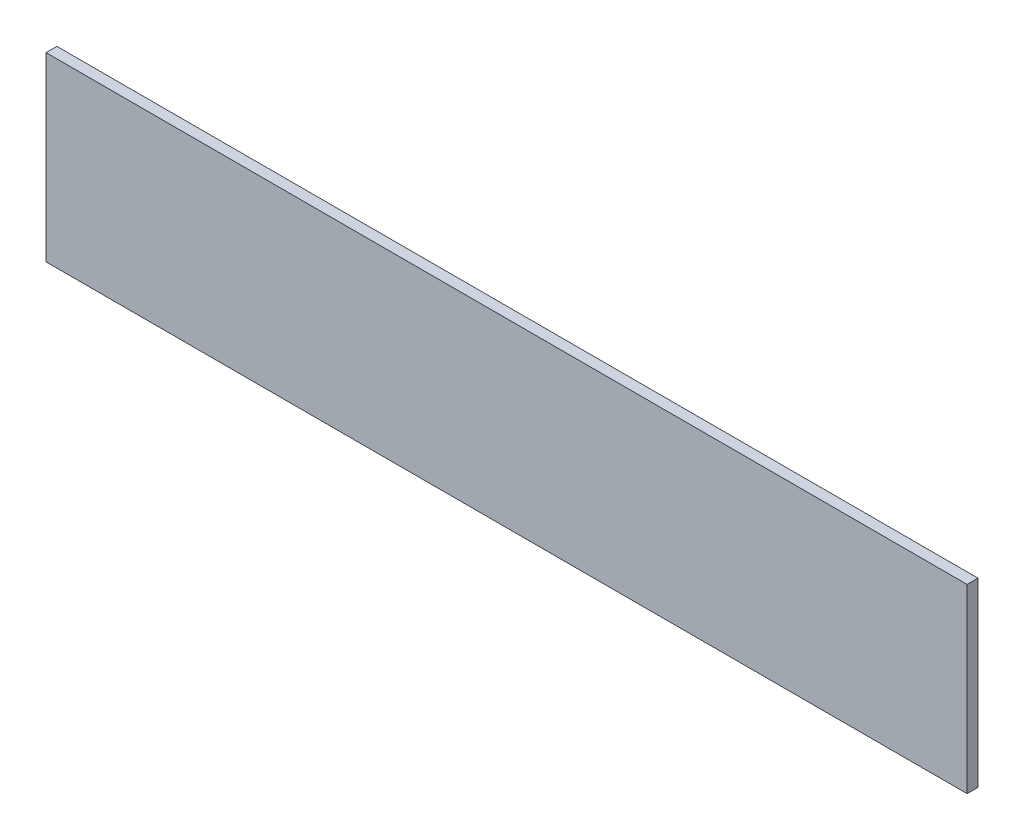
ISO-10303-21;
HEADER;
FILE_DESCRIPTION(('STEP AP214'),'2;1');
FILE_NAME('part.step','',(''),(''),'','','');
FILE_SCHEMA(('AUTOMOTIVE_DESIGN { 1 0 10303 214 1 1 1 1 }'));
ENDSEC;
DATA;
#1=APPLICATION_CONTEXT('core data for automotive mechanical design processes');
#2=APPLICATION_PROTOCOL_DEFINITION('international standard','automotive_design',2000,#1);
#3=PRODUCT_CONTEXT('',#1,'mechanical');
#4=PRODUCT('Part','Part','',(#3));
#5=PRODUCT_RELATED_PRODUCT_CATEGORY('part','',(#4));
#6=PRODUCT_DEFINITION_FORMATION('','',#4);
#7=PRODUCT_DEFINITION_CONTEXT('part definition',#1,'design');
#8=PRODUCT_DEFINITION('design','',#6,#7);
#9=PRODUCT_DEFINITION_SHAPE('','',#8);
#10=(LENGTH_UNIT() NAMED_UNIT(*) SI_UNIT(.MILLI.,.METRE.));
#11=(NAMED_UNIT(*) PLANE_ANGLE_UNIT() SI_UNIT($,.RADIAN.));
#12=(NAMED_UNIT(*) SI_UNIT($,.STERADIAN.) SOLID_ANGLE_UNIT());
#13=UNCERTAINTY_MEASURE_WITH_UNIT(LENGTH_MEASURE(1.E-05),#10,'distance_accuracy_value','');
#14=(GEOMETRIC_REPRESENTATION_CONTEXT(3) GLOBAL_UNCERTAINTY_ASSIGNED_CONTEXT((#13)) GLOBAL_UNIT_ASSIGNED_CONTEXT((#10,
#11,#12)) REPRESENTATION_CONTEXT('',''));
#15=CARTESIAN_POINT('',(0.,0.,0.));
#16=DIRECTION('',(0.,0.,1.));
#17=DIRECTION('',(1.,0.,0.));
#18=AXIS2_PLACEMENT_3D('',#15,#16,#17);
#19=CARTESIAN_POINT('',(762.5,150.,18.));
#20=DIRECTION('',(-1.,0.,0.));
#21=DIRECTION('',(0.,0.,1.));
#22=AXIS2_PLACEMENT_3D('',#19,#20,#21);
#23=PLANE('',#22);
#24=DIRECTION('',(0.,1.,0.));
#25=VECTOR('',#24,1.);
#26=CARTESIAN_POINT('',(762.5,150.,0.));
#27=LINE('',#26,#25);
#28=CARTESIAN_POINT('',(762.5,-150.,0.));
#29=VERTEX_POINT('',#28);
#30=CARTESIAN_POINT('',(762.5,150.,0.));
#31=VERTEX_POINT('',#30);
#32=EDGE_CURVE('E95',#29,#31,#27,.T.);
#33=ORIENTED_EDGE('',*,*,#32,.T.);
#34=DIRECTION('',(0.,0.,-1.));
#35=VECTOR('',#34,1.);
#36=CARTESIAN_POINT('',(762.5,150.,18.));
#37=LINE('',#36,#35);
#38=CARTESIAN_POINT('',(762.5,150.,18.));
#39=VERTEX_POINT('',#38);
#40=EDGE_CURVE('E11',#39,#31,#37,.T.);
#41=ORIENTED_EDGE('',*,*,#40,.F.);
#42=DIRECTION('',(0.,1.,0.));
#43=VECTOR('',#42,1.);
#44=CARTESIAN_POINT('',(762.5,150.,18.));
#45=LINE('',#44,#43);
#46=CARTESIAN_POINT('',(762.5,-150.,18.));
#47=VERTEX_POINT('',#46);
#48=EDGE_CURVE('E83',#47,#39,#45,.T.);
#49=ORIENTED_EDGE('',*,*,#48,.F.);
#50=DIRECTION('',(0.,0.,-1.));
#51=VECTOR('',#50,1.);
#52=CARTESIAN_POINT('',(762.5,-150.,18.));
#53=LINE('',#52,#51);
#54=EDGE_CURVE('E91',#47,#29,#53,.T.);
#55=ORIENTED_EDGE('',*,*,#54,.T.);
#56=EDGE_LOOP('',(#33,#41,#49,#55));
#57=FACE_BOUND('',#56,.T.);
#58=ADVANCED_FACE('F32',(#57),#23,.F.);
#59=CARTESIAN_POINT('',(-762.5,150.,18.));
#60=DIRECTION('',(0.,-1.,0.));
#61=DIRECTION('',(0.,0.,-1.));
#62=AXIS2_PLACEMENT_3D('',#59,#60,#61);
#63=PLANE('',#62);
#64=DIRECTION('',(-1.,0.,0.));
#65=VECTOR('',#64,1.);
#66=CARTESIAN_POINT('',(-762.5,150.,0.));
#67=LINE('',#66,#65);
#68=CARTESIAN_POINT('',(-762.5,150.,0.));
#69=VERTEX_POINT('',#68);
#70=EDGE_CURVE('E87',#31,#69,#67,.T.);
#71=ORIENTED_EDGE('',*,*,#70,.T.);
#72=DIRECTION('',(0.,0.,-1.));
#73=VECTOR('',#72,1.);
#74=CARTESIAN_POINT('',(-762.5,150.,18.));
#75=LINE('',#74,#73);
#76=CARTESIAN_POINT('',(-762.5,150.,18.));
#77=VERTEX_POINT('',#76);
#78=EDGE_CURVE('E40',#77,#69,#75,.T.);
#79=ORIENTED_EDGE('',*,*,#78,.F.);
#80=DIRECTION('',(-1.,0.,0.));
#81=VECTOR('',#80,1.);
#82=CARTESIAN_POINT('',(-762.5,150.,18.));
#83=LINE('',#82,#81);
#84=EDGE_CURVE('E78',#39,#77,#83,.T.);
#85=ORIENTED_EDGE('',*,*,#84,.F.);
#86=ORIENTED_EDGE('',*,*,#40,.T.);
#87=EDGE_LOOP('',(#71,#79,#85,#86));
#88=FACE_BOUND('',#87,.T.);
#89=ADVANCED_FACE('F86',(#88),#63,.F.);
#90=CARTESIAN_POINT('',(-762.5,150.,18.));
#91=DIRECTION('',(1.,0.,0.));
#92=DIRECTION('',(0.,0.,-1.));
#93=AXIS2_PLACEMENT_3D('',#90,#91,#92);
#94=PLANE('',#93);
#95=DIRECTION('',(0.,-1.,0.));
#96=VECTOR('',#95,1.);
#97=CARTESIAN_POINT('',(-762.5,150.,0.));
#98=LINE('',#97,#96);
#99=CARTESIAN_POINT('',(-762.5,-150.,0.));
#100=VERTEX_POINT('',#99);
#101=EDGE_CURVE('E65',#69,#100,#98,.T.);
#102=ORIENTED_EDGE('',*,*,#101,.T.);
#103=DIRECTION('',(0.,0.,-1.));
#104=VECTOR('',#103,1.);
#105=CARTESIAN_POINT('',(-762.5,-150.,18.));
#106=LINE('',#105,#104);
#107=CARTESIAN_POINT('',(-762.5,-150.,18.));
#108=VERTEX_POINT('',#107);
#109=EDGE_CURVE('E88',#108,#100,#106,.T.);
#110=ORIENTED_EDGE('',*,*,#109,.F.);
#111=DIRECTION('',(0.,-1.,0.));
#112=VECTOR('',#111,1.);
#113=CARTESIAN_POINT('',(-762.5,150.,18.));
#114=LINE('',#113,#112);
#115=EDGE_CURVE('E81',#77,#108,#114,.T.);
#116=ORIENTED_EDGE('',*,*,#115,.F.);
#117=ORIENTED_EDGE('',*,*,#78,.T.);
#118=EDGE_LOOP('',(#102,#110,#116,#117));
#119=FACE_BOUND('',#118,.T.);
#120=ADVANCED_FACE('F89',(#119),#94,.F.);
#121=CARTESIAN_POINT('',(-762.5,-150.,18.));
#122=DIRECTION('',(0.,1.,0.));
#123=DIRECTION('',(0.,0.,1.));
#124=AXIS2_PLACEMENT_3D('',#121,#122,#123);
#125=PLANE('',#124);
#126=DIRECTION('',(1.,0.,0.));
#127=VECTOR('',#126,1.);
#128=CARTESIAN_POINT('',(-762.5,-150.,0.));
#129=LINE('',#128,#127);
#130=EDGE_CURVE('E71',#100,#29,#129,.T.);
#131=ORIENTED_EDGE('',*,*,#130,.T.);
#132=ORIENTED_EDGE('',*,*,#54,.F.);
#133=DIRECTION('',(1.,0.,0.));
#134=VECTOR('',#133,1.);
#135=CARTESIAN_POINT('',(-762.5,-150.,18.));
#136=LINE('',#135,#134);
#137=EDGE_CURVE('E48',#108,#47,#136,.T.);
#138=ORIENTED_EDGE('',*,*,#137,.F.);
#139=ORIENTED_EDGE('',*,*,#109,.T.);
#140=EDGE_LOOP('',(#131,#132,#138,#139));
#141=FACE_BOUND('',#140,.T.);
#142=ADVANCED_FACE('F102',(#141),#125,.F.);
#143=CARTESIAN_POINT('',(0.,0.,18.));
#144=DIRECTION('',(0.,0.,1.));
#145=DIRECTION('',(1.,0.,0.));
#146=AXIS2_PLACEMENT_3D('',#143,#144,#145);
#147=PLANE('',#146);
#148=ORIENTED_EDGE('',*,*,#48,.T.);
#149=ORIENTED_EDGE('',*,*,#84,.T.);
#150=ORIENTED_EDGE('',*,*,#115,.T.);
#151=ORIENTED_EDGE('',*,*,#137,.T.);
#152=EDGE_LOOP('',(#148,#149,#150,#151));
#153=FACE_BOUND('',#152,.T.);
#154=ADVANCED_FACE('F79',(#153),#147,.T.);
#155=CARTESIAN_POINT('',(0.,0.,0.));
#156=DIRECTION('',(0.,0.,1.));
#157=DIRECTION('',(1.,0.,0.));
#158=AXIS2_PLACEMENT_3D('',#155,#156,#157);
#159=PLANE('',#158);
#160=ORIENTED_EDGE('',*,*,#32,.F.);
#161=ORIENTED_EDGE('',*,*,#130,.F.);
#162=ORIENTED_EDGE('',*,*,#101,.F.);
#163=ORIENTED_EDGE('',*,*,#70,.F.);
#164=EDGE_LOOP('',(#160,#161,#162,#163));
#165=FACE_BOUND('',#164,.T.);
#166=ADVANCED_FACE('F105',(#165),#159,.F.);
#167=CLOSED_SHELL('',(#58,#89,#120,#142,#154,#166));
#168=MANIFOLD_SOLID_BREP('B2',#167);
#169=ADVANCED_BREP_SHAPE_REPRESENTATION('',(#18,#168),#14);
#170=SHAPE_DEFINITION_REPRESENTATION(#9,#169);
ENDSEC;
END-ISO-10303-21;
